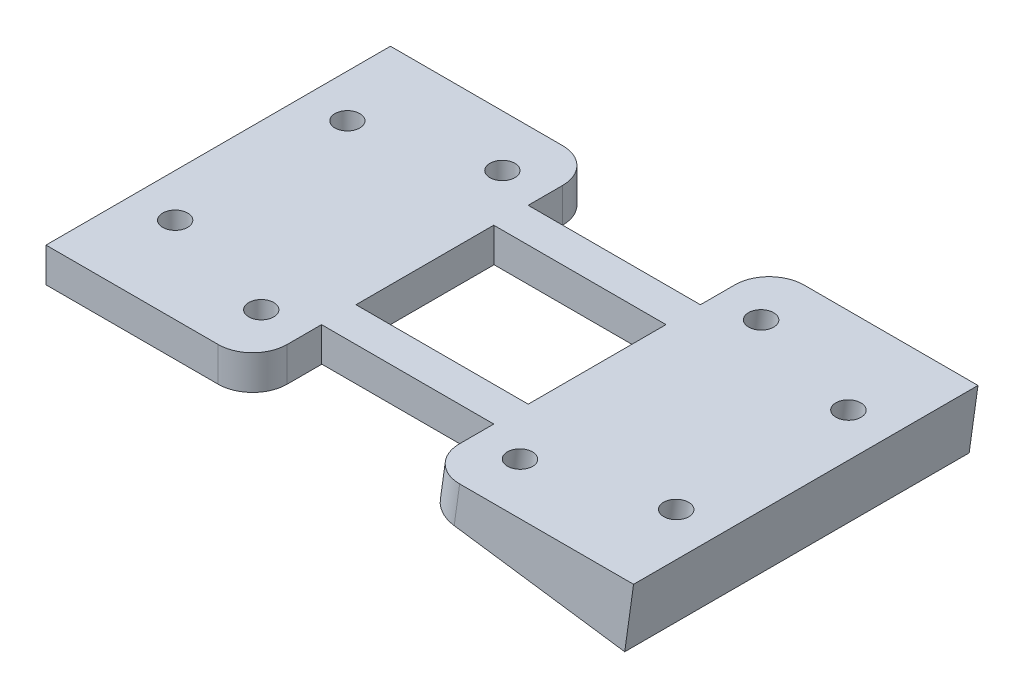
ISO-10303-21;
HEADER;
FILE_DESCRIPTION(('STEP AP214'),'2;1');
FILE_NAME('part.step','',(''),(''),'','','');
FILE_SCHEMA(('AUTOMOTIVE_DESIGN { 1 0 10303 214 1 1 1 1 }'));
ENDSEC;
DATA;
#1=APPLICATION_CONTEXT('core data for automotive mechanical design processes');
#2=APPLICATION_PROTOCOL_DEFINITION('international standard','automotive_design',2000,#1);
#3=PRODUCT_CONTEXT('',#1,'mechanical');
#4=PRODUCT('Part','Part','',(#3));
#5=PRODUCT_RELATED_PRODUCT_CATEGORY('part','',(#4));
#6=PRODUCT_DEFINITION_FORMATION('','',#4);
#7=PRODUCT_DEFINITION_CONTEXT('part definition',#1,'design');
#8=PRODUCT_DEFINITION('design','',#6,#7);
#9=PRODUCT_DEFINITION_SHAPE('','',#8);
#10=(LENGTH_UNIT() NAMED_UNIT(*) SI_UNIT(.MILLI.,.METRE.));
#11=(NAMED_UNIT(*) PLANE_ANGLE_UNIT() SI_UNIT($,.RADIAN.));
#12=(NAMED_UNIT(*) SI_UNIT($,.STERADIAN.) SOLID_ANGLE_UNIT());
#13=UNCERTAINTY_MEASURE_WITH_UNIT(LENGTH_MEASURE(1.E-05),#10,'distance_accuracy_value','');
#14=(GEOMETRIC_REPRESENTATION_CONTEXT(3) GLOBAL_UNCERTAINTY_ASSIGNED_CONTEXT((#13)) GLOBAL_UNIT_ASSIGNED_CONTEXT((#10,
#11,#12)) REPRESENTATION_CONTEXT('',''));
#15=CARTESIAN_POINT('',(0.,0.,0.));
#16=DIRECTION('',(0.,0.,1.));
#17=DIRECTION('',(1.,0.,0.));
#18=AXIS2_PLACEMENT_3D('',#15,#16,#17);
#19=CARTESIAN_POINT('',(16.6048706229787,-3.65061334900384,10.));
#20=DIRECTION('',(0.139173100960058,0.990268068741571,0.));
#21=DIRECTION('',(-0.990268068741571,0.139173100960058,0.));
#22=AXIS2_PLACEMENT_3D('',#19,#20,#21);
#23=PLANE('',#22);
#24=CARTESIAN_POINT('',(14.1292004511248,-3.3026805966037,5.));
#25=DIRECTION('',(0.139173100960059,0.990268068741571,0.));
#26=DIRECTION('',(0.990268068741571,-0.139173100960059,0.));
#27=AXIS2_PLACEMENT_3D('',#24,#25,#26);
#28=CIRCLE('',#27,0.725);
#29=CARTESIAN_POINT('',(14.8471448009625,-3.40358109479974,5.));
#30=VERTEX_POINT('',#29);
#31=EDGE_CURVE('E242',#30,#30,#28,.T.);
#32=ORIENTED_EDGE('',*,*,#31,.T.);
#33=EDGE_LOOP('',(#32));
#34=FACE_BOUND('',#33,.T.);
#35=CARTESIAN_POINT('',(7.19732396993381,-2.32846888988329,-7.));
#36=DIRECTION('',(0.139173100960059,0.990268068741571,0.));
#37=DIRECTION('',(-0.990268068741571,0.139173100960059,0.));
#38=AXIS2_PLACEMENT_3D('',#35,#36,#37);
#39=CIRCLE('',#38,0.725000000000001);
#40=CARTESIAN_POINT('',(6.47937962009617,-2.22756839168725,-7.));
#41=VERTEX_POINT('',#40);
#42=EDGE_CURVE('E234',#41,#41,#39,.T.);
#43=ORIENTED_EDGE('',*,*,#42,.T.);
#44=EDGE_LOOP('',(#43));
#45=FACE_BOUND('',#44,.T.);
#46=DIRECTION('',(0.990268068741571,-0.139173100960058,0.));
#47=VECTOR('',#46,1.);
#48=CARTESIAN_POINT('',(16.6048706229787,-3.65061334900384,10.));
#49=LINE('',#48,#47);
#50=CARTESIAN_POINT('',(6.70218993556303,-2.25888233940326,10.));
#51=VERTEX_POINT('',#50);
#52=CARTESIAN_POINT('',(16.6048706229787,-3.65061334900384,10.));
#53=VERTEX_POINT('',#52);
#54=EDGE_CURVE('E332',#51,#53,#49,.T.);
#55=ORIENTED_EDGE('',*,*,#54,.F.);
#56=CARTESIAN_POINT('',(6.70218993556302,-2.25888233940326,8.));
#57=DIRECTION('',(0.139173100960058,0.990268068741571,0.));
#58=DIRECTION('',(-0.990268068741571,0.139173100960058,0.));
#59=AXIS2_PLACEMENT_3D('',#56,#57,#58);
#60=CIRCLE('',#59,2.);
#61=CARTESIAN_POINT('',(4.72165379807988,-1.98053613748314,8.));
#62=VERTEX_POINT('',#61);
#63=EDGE_CURVE('E251',#51,#62,#60,.F.);
#64=ORIENTED_EDGE('',*,*,#63,.T.);
#65=DIRECTION('',(0.,0.,-1.));
#66=VECTOR('',#65,1.);
#67=CARTESIAN_POINT('',(4.72165379807988,-1.98053613748314,10.));
#68=LINE('',#67,#66);
#69=CARTESIAN_POINT('',(4.72165379807987,-1.98053613748314,6.));
#70=VERTEX_POINT('',#69);
#71=EDGE_CURVE('E218',#62,#70,#68,.T.);
#72=ORIENTED_EDGE('',*,*,#71,.T.);
#73=DIRECTION('',(0.,0.,1.));
#74=VECTOR('',#73,1.);
#75=CARTESIAN_POINT('',(4.72165379807987,-1.98053613748314,10.));
#76=LINE('',#75,#74);
#77=CARTESIAN_POINT('',(4.72165379807988,-1.98053613748314,4.));
#78=VERTEX_POINT('',#77);
#79=EDGE_CURVE('E194',#78,#70,#76,.T.);
#80=ORIENTED_EDGE('',*,*,#79,.F.);
#81=CARTESIAN_POINT('',(4.72165379807987,-1.98053613748314,-4.));
#82=VERTEX_POINT('',#81);
#83=EDGE_CURVE('E192',#78,#82,#68,.T.);
#84=ORIENTED_EDGE('',*,*,#83,.T.);
#85=CARTESIAN_POINT('',(4.72165379807988,-1.98053613748314,-6.));
#86=VERTEX_POINT('',#85);
#87=EDGE_CURVE('E221',#82,#86,#68,.T.);
#88=ORIENTED_EDGE('',*,*,#87,.T.);
#89=CARTESIAN_POINT('',(4.72165379807988,-1.98053613748314,-8.));
#90=VERTEX_POINT('',#89);
#91=EDGE_CURVE('E217',#86,#90,#68,.T.);
#92=ORIENTED_EDGE('',*,*,#91,.T.);
#93=CARTESIAN_POINT('',(6.70218993556303,-2.25888233940326,-8.));
#94=DIRECTION('',(0.139173100960058,0.990268068741571,0.));
#95=DIRECTION('',(-0.990268068741571,0.139173100960058,0.));
#96=AXIS2_PLACEMENT_3D('',#93,#94,#95);
#97=CIRCLE('',#96,2.);
#98=CARTESIAN_POINT('',(6.70218993556303,-2.25888233940326,-10.));
#99=VERTEX_POINT('',#98);
#100=EDGE_CURVE('E249',#90,#99,#97,.F.);
#101=ORIENTED_EDGE('',*,*,#100,.T.);
#102=DIRECTION('',(0.990268068741571,-0.139173100960058,0.));
#103=VECTOR('',#102,1.);
#104=CARTESIAN_POINT('',(16.6048706229787,-3.65061334900384,-10.));
#105=LINE('',#104,#103);
#106=CARTESIAN_POINT('',(16.6048706229787,-3.65061334900384,-10.));
#107=VERTEX_POINT('',#106);
#108=EDGE_CURVE('E331',#99,#107,#105,.T.);
#109=ORIENTED_EDGE('',*,*,#108,.T.);
#110=DIRECTION('',(0.,0.,-1.));
#111=VECTOR('',#110,1.);
#112=CARTESIAN_POINT('',(16.6048706229787,-3.65061334900384,10.));
#113=LINE('',#112,#111);
#114=EDGE_CURVE('E214',#53,#107,#113,.T.);
#115=ORIENTED_EDGE('',*,*,#114,.F.);
#116=EDGE_LOOP('',(#55,#64,#72,#80,#84,#88,#92,#101,#109,#115));
#117=FACE_BOUND('',#116,.T.);
#118=CARTESIAN_POINT('',(14.1292004511248,-3.3026805966037,-5.));
#119=DIRECTION('',(0.139173100960059,0.990268068741571,0.));
#120=DIRECTION('',(-0.990268068741571,0.139173100960059,0.));
#121=AXIS2_PLACEMENT_3D('',#118,#119,#120);
#122=CIRCLE('',#121,0.725);
#123=CARTESIAN_POINT('',(13.4112561012872,-3.20178009840766,-5.));
#124=VERTEX_POINT('',#123);
#125=EDGE_CURVE('E238',#124,#124,#122,.T.);
#126=ORIENTED_EDGE('',*,*,#125,.T.);
#127=EDGE_LOOP('',(#126));
#128=FACE_BOUND('',#127,.T.);
#129=CARTESIAN_POINT('',(7.19732396993381,-2.32846888988329,7.));
#130=DIRECTION('',(0.139173100960059,0.990268068741571,0.));
#131=DIRECTION('',(0.990268068741571,-0.139173100960059,0.));
#132=AXIS2_PLACEMENT_3D('',#129,#130,#131);
#133=CIRCLE('',#132,0.725000000000001);
#134=CARTESIAN_POINT('',(7.91526831977145,-2.42936938807933,7.));
#135=VERTEX_POINT('',#134);
#136=EDGE_CURVE('E246',#135,#135,#133,.T.);
#137=ORIENTED_EDGE('',*,*,#136,.T.);
#138=EDGE_LOOP('',(#137));
#139=FACE_BOUND('',#138,.T.);
#140=ADVANCED_FACE('F33',(#34,#45,#117,#128,#139),#23,.F.);
#141=CARTESIAN_POINT('',(5.,0.,10.));
#142=DIRECTION('',(0.,-1.,0.));
#143=DIRECTION('',(0.,0.,-1.));
#144=AXIS2_PLACEMENT_3D('',#141,#142,#143);
#145=PLANE('',#144);
#146=CARTESIAN_POINT('',(-7.5,1.69569219776733E-13,-7.));
#147=DIRECTION('',(0.,-1.,0.));
#148=DIRECTION('',(-1.,0.,0.));
#149=AXIS2_PLACEMENT_3D('',#146,#147,#148);
#150=CIRCLE('',#149,0.725);
#151=CARTESIAN_POINT('',(-8.225,1.74559672272423E-13,-7.));
#152=VERTEX_POINT('',#151);
#153=EDGE_CURVE('E453',#152,#152,#150,.T.);
#154=ORIENTED_EDGE('',*,*,#153,.T.);
#155=EDGE_LOOP('',(#154));
#156=FACE_BOUND('',#155,.T.);
#157=CARTESIAN_POINT('',(-14.5,2.17707796235089E-13,-5.));
#158=DIRECTION('',(0.,-1.,0.));
#159=DIRECTION('',(-1.,0.,0.));
#160=AXIS2_PLACEMENT_3D('',#157,#158,#159);
#161=CIRCLE('',#160,0.725);
#162=CARTESIAN_POINT('',(-15.225,2.22698248730779E-13,-5.));
#163=VERTEX_POINT('',#162);
#164=EDGE_CURVE('E447',#163,#163,#161,.T.);
#165=ORIENTED_EDGE('',*,*,#164,.T.);
#166=EDGE_LOOP('',(#165));
#167=FACE_BOUND('',#166,.T.);
#168=CARTESIAN_POINT('',(-14.5,2.17707796235089E-13,5.));
#169=DIRECTION('',(0.,-1.,0.));
#170=DIRECTION('',(1.,0.,0.));
#171=AXIS2_PLACEMENT_3D('',#168,#169,#170);
#172=CIRCLE('',#171,0.725);
#173=CARTESIAN_POINT('',(-13.775,2.12717343739399E-13,5.));
#174=VERTEX_POINT('',#173);
#175=EDGE_CURVE('E441',#174,#174,#172,.T.);
#176=ORIENTED_EDGE('',*,*,#175,.T.);
#177=EDGE_LOOP('',(#176));
#178=FACE_BOUND('',#177,.T.);
#179=CARTESIAN_POINT('',(-7.5,1.69569219776733E-13,7.));
#180=DIRECTION('',(0.,-1.,0.));
#181=DIRECTION('',(1.,0.,0.));
#182=AXIS2_PLACEMENT_3D('',#179,#180,#181);
#183=CIRCLE('',#182,0.725);
#184=CARTESIAN_POINT('',(-6.775,1.64578767281043E-13,7.));
#185=VERTEX_POINT('',#184);
#186=EDGE_CURVE('E437',#185,#185,#183,.T.);
#187=ORIENTED_EDGE('',*,*,#186,.T.);
#188=EDGE_LOOP('',(#187));
#189=FACE_BOUND('',#188,.T.);
#190=CARTESIAN_POINT('',(14.5933619389269,0.,5.));
#191=DIRECTION('',(0.,-1.,0.));
#192=DIRECTION('',(-1.,0.,0.));
#193=AXIS2_PLACEMENT_3D('',#190,#191,#192);
#194=ELLIPSE('',#193,0.732124990075997,0.725);
#195=CARTESIAN_POINT('',(13.8612369488509,0.,5.));
#196=VERTEX_POINT('',#195);
#197=EDGE_CURVE('E239',#196,#196,#194,.F.);
#198=ORIENTED_EDGE('',*,*,#197,.F.);
#199=EDGE_LOOP('',(#198));
#200=FACE_BOUND('',#199,.T.);
#201=CARTESIAN_POINT('',(7.52456893129654,0.,-7.));
#202=DIRECTION('',(0.,-1.,0.));
#203=DIRECTION('',(-1.,0.,0.));
#204=AXIS2_PLACEMENT_3D('',#201,#202,#203);
#205=ELLIPSE('',#204,0.732124990075998,0.725000000000001);
#206=CARTESIAN_POINT('',(6.79244394122055,0.,-7.));
#207=VERTEX_POINT('',#206);
#208=EDGE_CURVE('E185',#207,#207,#205,.F.);
#209=ORIENTED_EDGE('',*,*,#208,.F.);
#210=EDGE_LOOP('',(#209));
#211=FACE_BOUND('',#210,.T.);
#212=DIRECTION('',(0.,0.,-1.));
#213=VECTOR('',#212,1.);
#214=CARTESIAN_POINT('',(5.,0.,10.));
#215=LINE('',#214,#213);
#216=CARTESIAN_POINT('',(5.,0.,4.));
#217=VERTEX_POINT('',#216);
#218=CARTESIAN_POINT('',(5.,0.,-4.));
#219=VERTEX_POINT('',#218);
#220=EDGE_CURVE('E190',#217,#219,#215,.T.);
#221=ORIENTED_EDGE('',*,*,#220,.F.);
#222=DIRECTION('',(-1.,0.,0.));
#223=VECTOR('',#222,1.);
#224=CARTESIAN_POINT('',(6.,0.,4.));
#225=LINE('',#224,#223);
#226=CARTESIAN_POINT('',(-5.00000000000001,0.,4.));
#227=VERTEX_POINT('',#226);
#228=EDGE_CURVE('E175',#217,#227,#225,.T.);
#229=ORIENTED_EDGE('',*,*,#228,.T.);
#230=DIRECTION('',(0.,0.,-1.));
#231=VECTOR('',#230,1.);
#232=CARTESIAN_POINT('',(-5.,0.,10.));
#233=LINE('',#232,#231);
#234=CARTESIAN_POINT('',(-5.,0.,-4.));
#235=VERTEX_POINT('',#234);
#236=EDGE_CURVE('E312',#227,#235,#233,.T.);
#237=ORIENTED_EDGE('',*,*,#236,.T.);
#238=DIRECTION('',(-1.,0.,0.));
#239=VECTOR('',#238,1.);
#240=CARTESIAN_POINT('',(6.,0.,-4.));
#241=LINE('',#240,#239);
#242=EDGE_CURVE('E201',#219,#235,#241,.T.);
#243=ORIENTED_EDGE('',*,*,#242,.F.);
#244=EDGE_LOOP('',(#221,#229,#237,#243));
#245=FACE_BOUND('',#244,.T.);
#246=CARTESIAN_POINT('',(-5.,0.,-6.));
#247=VERTEX_POINT('',#246);
#248=CARTESIAN_POINT('',(-5.,0.,-8.));
#249=VERTEX_POINT('',#248);
#250=EDGE_CURVE('E296',#247,#249,#233,.T.);
#251=ORIENTED_EDGE('',*,*,#250,.T.);
#252=CARTESIAN_POINT('',(-7.,0.,-8.));
#253=DIRECTION('',(0.,-1.,0.));
#254=DIRECTION('',(0.,0.,-1.));
#255=AXIS2_PLACEMENT_3D('',#252,#253,#254);
#256=CIRCLE('',#255,2.);
#257=CARTESIAN_POINT('',(-7.,0.,-10.));
#258=VERTEX_POINT('',#257);
#259=EDGE_CURVE('E271',#249,#258,#256,.F.);
#260=ORIENTED_EDGE('',*,*,#259,.T.);
#261=DIRECTION('',(-1.,0.,0.));
#262=VECTOR('',#261,1.);
#263=CARTESIAN_POINT('',(-5.,0.,-10.));
#264=LINE('',#263,#262);
#265=CARTESIAN_POINT('',(-17.,0.,-10.));
#266=VERTEX_POINT('',#265);
#267=EDGE_CURVE('E293',#258,#266,#264,.T.);
#268=ORIENTED_EDGE('',*,*,#267,.T.);
#269=DIRECTION('',(0.,0.,-1.));
#270=VECTOR('',#269,1.);
#271=CARTESIAN_POINT('',(-17.,0.,10.));
#272=LINE('',#271,#270);
#273=CARTESIAN_POINT('',(-17.,0.,10.));
#274=VERTEX_POINT('',#273);
#275=EDGE_CURVE('E309',#274,#266,#272,.T.);
#276=ORIENTED_EDGE('',*,*,#275,.F.);
#277=DIRECTION('',(-1.,0.,0.));
#278=VECTOR('',#277,1.);
#279=CARTESIAN_POINT('',(-5.,0.,10.));
#280=LINE('',#279,#278);
#281=CARTESIAN_POINT('',(-7.,0.,10.));
#282=VERTEX_POINT('',#281);
#283=EDGE_CURVE('E416',#282,#274,#280,.T.);
#284=ORIENTED_EDGE('',*,*,#283,.F.);
#285=CARTESIAN_POINT('',(-7.,0.,8.));
#286=DIRECTION('',(0.,-1.,0.));
#287=DIRECTION('',(0.,0.,-1.));
#288=AXIS2_PLACEMENT_3D('',#285,#286,#287);
#289=CIRCLE('',#288,2.);
#290=CARTESIAN_POINT('',(-5.,0.,8.));
#291=VERTEX_POINT('',#290);
#292=EDGE_CURVE('E269',#282,#291,#289,.F.);
#293=ORIENTED_EDGE('',*,*,#292,.T.);
#294=CARTESIAN_POINT('',(-5.,0.,6.));
#295=VERTEX_POINT('',#294);
#296=EDGE_CURVE('E288',#291,#295,#233,.T.);
#297=ORIENTED_EDGE('',*,*,#296,.T.);
#298=DIRECTION('',(-1.,0.,0.));
#299=VECTOR('',#298,1.);
#300=CARTESIAN_POINT('',(6.,0.,6.));
#301=LINE('',#300,#299);
#302=CARTESIAN_POINT('',(5.,0.,6.));
#303=VERTEX_POINT('',#302);
#304=EDGE_CURVE('E195',#303,#295,#301,.T.);
#305=ORIENTED_EDGE('',*,*,#304,.F.);
#306=CARTESIAN_POINT('',(5.,0.,8.));
#307=VERTEX_POINT('',#306);
#308=EDGE_CURVE('E202',#307,#303,#215,.T.);
#309=ORIENTED_EDGE('',*,*,#308,.F.);
#310=CARTESIAN_POINT('',(7.01965514503723,0.,8.));
#311=DIRECTION('',(0.,-1.,0.));
#312=DIRECTION('',(-1.,0.,0.));
#313=AXIS2_PLACEMENT_3D('',#310,#311,#312);
#314=ELLIPSE('',#313,2.01965514503723,2.);
#315=CARTESIAN_POINT('',(7.01965514503723,0.,10.));
#316=VERTEX_POINT('',#315);
#317=EDGE_CURVE('E257',#307,#316,#314,.F.);
#318=ORIENTED_EDGE('',*,*,#317,.T.);
#319=DIRECTION('',(-1.,0.,0.));
#320=VECTOR('',#319,1.);
#321=CARTESIAN_POINT('',(5.,0.,10.));
#322=LINE('',#321,#320);
#323=CARTESIAN_POINT('',(17.1179308702234,0.,10.));
#324=VERTEX_POINT('',#323);
#325=EDGE_CURVE('E207',#324,#316,#322,.T.);
#326=ORIENTED_EDGE('',*,*,#325,.F.);
#327=DIRECTION('',(0.,0.,-1.));
#328=VECTOR('',#327,1.);
#329=CARTESIAN_POINT('',(17.1179308702234,0.,10.));
#330=LINE('',#329,#328);
#331=CARTESIAN_POINT('',(17.1179308702234,0.,-10.));
#332=VERTEX_POINT('',#331);
#333=EDGE_CURVE('E205',#324,#332,#330,.T.);
#334=ORIENTED_EDGE('',*,*,#333,.T.);
#335=DIRECTION('',(-1.,0.,0.));
#336=VECTOR('',#335,1.);
#337=CARTESIAN_POINT('',(5.,0.,-10.));
#338=LINE('',#337,#336);
#339=CARTESIAN_POINT('',(7.01965514503723,0.,-10.));
#340=VERTEX_POINT('',#339);
#341=EDGE_CURVE('E210',#332,#340,#338,.T.);
#342=ORIENTED_EDGE('',*,*,#341,.T.);
#343=CARTESIAN_POINT('',(7.01965514503723,0.,-8.));
#344=DIRECTION('',(0.,-1.,0.));
#345=DIRECTION('',(1.,0.,0.));
#346=AXIS2_PLACEMENT_3D('',#343,#344,#345);
#347=ELLIPSE('',#346,2.01965514503723,2.);
#348=CARTESIAN_POINT('',(5.,0.,-8.));
#349=VERTEX_POINT('',#348);
#350=EDGE_CURVE('E255',#340,#349,#347,.F.);
#351=ORIENTED_EDGE('',*,*,#350,.T.);
#352=CARTESIAN_POINT('',(5.,0.,-6.));
#353=VERTEX_POINT('',#352);
#354=EDGE_CURVE('E203',#353,#349,#215,.T.);
#355=ORIENTED_EDGE('',*,*,#354,.F.);
#356=DIRECTION('',(-1.,0.,0.));
#357=VECTOR('',#356,1.);
#358=CARTESIAN_POINT('',(6.,0.,-6.));
#359=LINE('',#358,#357);
#360=EDGE_CURVE('E324',#353,#247,#359,.T.);
#361=ORIENTED_EDGE('',*,*,#360,.T.);
#362=EDGE_LOOP('',(#251,#260,#268,#276,#284,#293,#297,#305,#309,#318,#326,#334,#342,#351,#355,#361));
#363=FACE_BOUND('',#362,.T.);
#364=CARTESIAN_POINT('',(14.5933619389269,0.,-5.));
#365=DIRECTION('',(0.,-1.,0.));
#366=DIRECTION('',(-1.,0.,0.));
#367=AXIS2_PLACEMENT_3D('',#364,#365,#366);
#368=ELLIPSE('',#367,0.732124990075997,0.725);
#369=CARTESIAN_POINT('',(13.8612369488509,0.,-5.));
#370=VERTEX_POINT('',#369);
#371=EDGE_CURVE('E235',#370,#370,#368,.F.);
#372=ORIENTED_EDGE('',*,*,#371,.F.);
#373=EDGE_LOOP('',(#372));
#374=FACE_BOUND('',#373,.T.);
#375=CARTESIAN_POINT('',(7.52456893129654,0.,7.));
#376=DIRECTION('',(0.,-1.,0.));
#377=DIRECTION('',(-1.,0.,0.));
#378=AXIS2_PLACEMENT_3D('',#375,#376,#377);
#379=ELLIPSE('',#378,0.732124990075998,0.725000000000001);
#380=CARTESIAN_POINT('',(6.79244394122055,0.,7.));
#381=VERTEX_POINT('',#380);
#382=EDGE_CURVE('E243',#381,#381,#379,.F.);
#383=ORIENTED_EDGE('',*,*,#382,.F.);
#384=EDGE_LOOP('',(#383));
#385=FACE_BOUND('',#384,.T.);
#386=ADVANCED_FACE('F198',(#156,#167,#178,#189,#200,#211,#245,#363,#374,#385),#145,.F.);
#387=CARTESIAN_POINT('',(5.,0.,10.));
#388=DIRECTION('',(0.990268068741571,-0.139173100960058,0.));
#389=DIRECTION('',(0.139173100960058,0.990268068741571,0.));
#390=AXIS2_PLACEMENT_3D('',#387,#388,#389);
#391=PLANE('',#390);
#392=ORIENTED_EDGE('',*,*,#71,.F.);
#393=DIRECTION('',(-0.139173100960058,-0.990268068741571,0.));
#394=VECTOR('',#393,1.);
#395=CARTESIAN_POINT('',(5.,0.,8.));
#396=LINE('',#395,#394);
#397=EDGE_CURVE('E253',#62,#307,#396,.F.);
#398=ORIENTED_EDGE('',*,*,#397,.T.);
#399=ORIENTED_EDGE('',*,*,#308,.T.);
#400=DIRECTION('',(0.139173100960058,0.990268068741571,0.));
#401=VECTOR('',#400,1.);
#402=CARTESIAN_POINT('',(5.,0.,6.));
#403=LINE('',#402,#401);
#404=EDGE_CURVE('E303',#70,#303,#403,.T.);
#405=ORIENTED_EDGE('',*,*,#404,.F.);
#406=EDGE_LOOP('',(#392,#398,#399,#405));
#407=FACE_BOUND('',#406,.T.);
#408=ADVANCED_FACE('F389',(#407),#391,.F.);
#409=DIRECTION('',(-0.139173100960058,-0.990268068741571,0.));
#410=VECTOR('',#409,1.);
#411=CARTESIAN_POINT('',(5.,0.,4.));
#412=LINE('',#411,#410);
#413=EDGE_CURVE('E179',#217,#78,#412,.T.);
#414=ORIENTED_EDGE('',*,*,#413,.F.);
#415=ORIENTED_EDGE('',*,*,#220,.T.);
#416=DIRECTION('',(0.139173100960058,0.990268068741571,0.));
#417=VECTOR('',#416,1.);
#418=CARTESIAN_POINT('',(5.,0.,-4.));
#419=LINE('',#418,#417);
#420=EDGE_CURVE('E326',#82,#219,#419,.T.);
#421=ORIENTED_EDGE('',*,*,#420,.F.);
#422=ORIENTED_EDGE('',*,*,#83,.F.);
#423=EDGE_LOOP('',(#414,#415,#421,#422));
#424=FACE_BOUND('',#423,.T.);
#425=ADVANCED_FACE('F188',(#424),#391,.F.);
#426=CARTESIAN_POINT('',(-5.00000000000001,-2.,10.));
#427=DIRECTION('',(-1.,0.,0.));
#428=DIRECTION('',(0.,-1.,0.));
#429=AXIS2_PLACEMENT_3D('',#426,#427,#428);
#430=PLANE('',#429);
#431=DIRECTION('',(0.,0.,-1.));
#432=VECTOR('',#431,1.);
#433=CARTESIAN_POINT('',(-5.00000000000001,-2.,10.));
#434=LINE('',#433,#432);
#435=CARTESIAN_POINT('',(-5.00000000000001,-2.,8.));
#436=VERTEX_POINT('',#435);
#437=CARTESIAN_POINT('',(-5.00000000000001,-2.,-8.));
#438=VERTEX_POINT('',#437);
#439=EDGE_CURVE('E277',#436,#438,#434,.T.);
#440=ORIENTED_EDGE('',*,*,#439,.T.);
#441=DIRECTION('',(0.,1.,0.));
#442=VECTOR('',#441,1.);
#443=CARTESIAN_POINT('',(-5.00000000000001,-2.,-8.));
#444=LINE('',#443,#442);
#445=EDGE_CURVE('E266',#438,#249,#444,.T.);
#446=ORIENTED_EDGE('',*,*,#445,.T.);
#447=ORIENTED_EDGE('',*,*,#250,.F.);
#448=DIRECTION('',(0.,-1.,0.));
#449=VECTOR('',#448,1.);
#450=CARTESIAN_POINT('',(-5.,0.,-6.));
#451=LINE('',#450,#449);
#452=CARTESIAN_POINT('',(-5.00000000000001,-1.98053613748314,-6.));
#453=VERTEX_POINT('',#452);
#454=EDGE_CURVE('E315',#247,#453,#451,.T.);
#455=ORIENTED_EDGE('',*,*,#454,.T.);
#456=DIRECTION('',(0.,0.,1.));
#457=VECTOR('',#456,1.);
#458=CARTESIAN_POINT('',(-5.00000000000001,-1.98053613748314,-6.));
#459=LINE('',#458,#457);
#460=CARTESIAN_POINT('',(-5.00000000000001,-1.98053613748314,-4.));
#461=VERTEX_POINT('',#460);
#462=EDGE_CURVE('E287',#453,#461,#459,.T.);
#463=ORIENTED_EDGE('',*,*,#462,.T.);
#464=DIRECTION('',(0.,1.,0.));
#465=VECTOR('',#464,1.);
#466=CARTESIAN_POINT('',(-5.,0.,-4.));
#467=LINE('',#466,#465);
#468=EDGE_CURVE('E220',#461,#235,#467,.T.);
#469=ORIENTED_EDGE('',*,*,#468,.T.);
#470=ORIENTED_EDGE('',*,*,#236,.F.);
#471=DIRECTION('',(0.,1.,0.));
#472=VECTOR('',#471,1.);
#473=CARTESIAN_POINT('',(-5.00000000000001,-2.,4.));
#474=LINE('',#473,#472);
#475=CARTESIAN_POINT('',(-5.00000000000001,-1.98053613748314,4.));
#476=VERTEX_POINT('',#475);
#477=EDGE_CURVE('E181',#476,#227,#474,.T.);
#478=ORIENTED_EDGE('',*,*,#477,.F.);
#479=DIRECTION('',(0.,0.,-1.));
#480=VECTOR('',#479,1.);
#481=CARTESIAN_POINT('',(-5.00000000000001,-1.98053613748314,10.));
#482=LINE('',#481,#480);
#483=CARTESIAN_POINT('',(-5.00000000000001,-1.98053613748314,6.));
#484=VERTEX_POINT('',#483);
#485=EDGE_CURVE('E225',#484,#476,#482,.T.);
#486=ORIENTED_EDGE('',*,*,#485,.F.);
#487=DIRECTION('',(0.,-1.,0.));
#488=VECTOR('',#487,1.);
#489=CARTESIAN_POINT('',(-5.00000000000001,-2.,6.));
#490=LINE('',#489,#488);
#491=EDGE_CURVE('E228',#295,#484,#490,.T.);
#492=ORIENTED_EDGE('',*,*,#491,.F.);
#493=ORIENTED_EDGE('',*,*,#296,.F.);
#494=DIRECTION('',(0.,1.,0.));
#495=VECTOR('',#494,1.);
#496=CARTESIAN_POINT('',(-5.00000000000001,-2.,8.));
#497=LINE('',#496,#495);
#498=EDGE_CURVE('E264',#291,#436,#497,.F.);
#499=ORIENTED_EDGE('',*,*,#498,.T.);
#500=EDGE_LOOP('',(#440,#446,#447,#455,#463,#469,#470,#478,#486,#492,#493,#499));
#501=FACE_BOUND('',#500,.T.);
#502=ADVANCED_FACE('F283',(#501),#430,.F.);
#503=CARTESIAN_POINT('',(6.,-1.98053613748314,-6.));
#504=DIRECTION('',(0.,1.,0.));
#505=DIRECTION('',(0.,0.,1.));
#506=AXIS2_PLACEMENT_3D('',#503,#504,#505);
#507=PLANE('',#506);
#508=ORIENTED_EDGE('',*,*,#462,.F.);
#509=DIRECTION('',(-1.,0.,0.));
#510=VECTOR('',#509,1.);
#511=CARTESIAN_POINT('',(6.,-1.98053613748314,-6.));
#512=LINE('',#511,#510);
#513=EDGE_CURVE('E317',#86,#453,#512,.T.);
#514=ORIENTED_EDGE('',*,*,#513,.F.);
#515=ORIENTED_EDGE('',*,*,#87,.F.);
#516=DIRECTION('',(-1.,0.,0.));
#517=VECTOR('',#516,1.);
#518=CARTESIAN_POINT('',(6.,-1.98053613748314,-4.));
#519=LINE('',#518,#517);
#520=EDGE_CURVE('E320',#82,#461,#519,.T.);
#521=ORIENTED_EDGE('',*,*,#520,.T.);
#522=EDGE_LOOP('',(#508,#514,#515,#521));
#523=FACE_BOUND('',#522,.T.);
#524=ADVANCED_FACE('F367',(#523),#507,.F.);
#525=CARTESIAN_POINT('',(6.,0.,-6.));
#526=DIRECTION('',(0.,0.,1.));
#527=DIRECTION('',(1.,0.,0.));
#528=AXIS2_PLACEMENT_3D('',#525,#526,#527);
#529=PLANE('',#528);
#530=ORIENTED_EDGE('',*,*,#454,.F.);
#531=ORIENTED_EDGE('',*,*,#360,.F.);
#532=DIRECTION('',(-0.139173100960058,-0.990268068741571,0.));
#533=VECTOR('',#532,1.);
#534=CARTESIAN_POINT('',(5.,0.,-6.));
#535=LINE('',#534,#533);
#536=EDGE_CURVE('E328',#353,#86,#535,.T.);
#537=ORIENTED_EDGE('',*,*,#536,.T.);
#538=ORIENTED_EDGE('',*,*,#513,.T.);
#539=EDGE_LOOP('',(#530,#531,#537,#538));
#540=FACE_BOUND('',#539,.T.);
#541=ADVANCED_FACE('F373',(#540),#529,.F.);
#542=CARTESIAN_POINT('',(6.,0.,-4.));
#543=DIRECTION('',(0.,0.,-1.));
#544=DIRECTION('',(-1.,0.,0.));
#545=AXIS2_PLACEMENT_3D('',#542,#543,#544);
#546=PLANE('',#545);
#547=ORIENTED_EDGE('',*,*,#468,.F.);
#548=ORIENTED_EDGE('',*,*,#520,.F.);
#549=ORIENTED_EDGE('',*,*,#420,.T.);
#550=ORIENTED_EDGE('',*,*,#242,.T.);
#551=EDGE_LOOP('',(#547,#548,#549,#550));
#552=FACE_BOUND('',#551,.T.);
#553=ADVANCED_FACE('F370',(#552),#546,.F.);
#554=ORIENTED_EDGE('',*,*,#354,.T.);
#555=DIRECTION('',(-0.139173100960058,-0.990268068741571,0.));
#556=VECTOR('',#555,1.);
#557=CARTESIAN_POINT('',(4.72165379807988,-1.98053613748314,-8.));
#558=LINE('',#557,#556);
#559=EDGE_CURVE('E259',#349,#90,#558,.T.);
#560=ORIENTED_EDGE('',*,*,#559,.T.);
#561=ORIENTED_EDGE('',*,*,#91,.F.);
#562=ORIENTED_EDGE('',*,*,#536,.F.);
#563=EDGE_LOOP('',(#554,#560,#561,#562));
#564=FACE_BOUND('',#563,.T.);
#565=ADVANCED_FACE('F355',(#564),#391,.F.);
#566=CARTESIAN_POINT('',(17.1179308702234,0.,10.));
#567=DIRECTION('',(-0.990268068741571,0.139173100960058,0.));
#568=DIRECTION('',(-0.139173100960058,-0.990268068741571,0.));
#569=AXIS2_PLACEMENT_3D('',#566,#567,#568);
#570=PLANE('',#569);
#571=DIRECTION('',(0.139173100960058,0.990268068741571,0.));
#572=VECTOR('',#571,1.);
#573=CARTESIAN_POINT('',(17.1179308702234,0.,-10.));
#574=LINE('',#573,#572);
#575=EDGE_CURVE('E338',#107,#332,#574,.T.);
#576=ORIENTED_EDGE('',*,*,#575,.T.);
#577=ORIENTED_EDGE('',*,*,#333,.F.);
#578=DIRECTION('',(0.139173100960058,0.990268068741571,0.));
#579=VECTOR('',#578,1.);
#580=CARTESIAN_POINT('',(17.1179308702234,0.,10.));
#581=LINE('',#580,#579);
#582=EDGE_CURVE('E334',#53,#324,#581,.T.);
#583=ORIENTED_EDGE('',*,*,#582,.F.);
#584=ORIENTED_EDGE('',*,*,#114,.T.);
#585=EDGE_LOOP('',(#576,#577,#583,#584));
#586=FACE_BOUND('',#585,.T.);
#587=ADVANCED_FACE('F396',(#586),#570,.F.);
#588=CARTESIAN_POINT('',(0.,0.,10.));
#589=DIRECTION('',(0.,0.,-1.));
#590=DIRECTION('',(-1.,0.,0.));
#591=AXIS2_PLACEMENT_3D('',#588,#589,#590);
#592=PLANE('',#591);
#593=ORIENTED_EDGE('',*,*,#325,.T.);
#594=DIRECTION('',(-0.139173100960058,-0.990268068741571,0.));
#595=VECTOR('',#594,1.);
#596=CARTESIAN_POINT('',(6.88369037732895,-0.967439591462579,10.));
#597=LINE('',#596,#595);
#598=EDGE_CURVE('E231',#316,#51,#597,.T.);
#599=ORIENTED_EDGE('',*,*,#598,.T.);
#600=ORIENTED_EDGE('',*,*,#54,.T.);
#601=ORIENTED_EDGE('',*,*,#582,.T.);
#602=EDGE_LOOP('',(#593,#599,#600,#601));
#603=FACE_BOUND('',#602,.T.);
#604=ADVANCED_FACE('F544',(#603),#592,.F.);
#605=CARTESIAN_POINT('',(0.,0.,-10.));
#606=DIRECTION('',(0.,0.,-1.));
#607=DIRECTION('',(-1.,0.,0.));
#608=AXIS2_PLACEMENT_3D('',#605,#606,#607);
#609=PLANE('',#608);
#610=ORIENTED_EDGE('',*,*,#108,.F.);
#611=DIRECTION('',(-0.139173100960058,-0.990268068741571,0.));
#612=VECTOR('',#611,1.);
#613=CARTESIAN_POINT('',(6.98053613748314,-0.278346201920117,-10.));
#614=LINE('',#613,#612);
#615=EDGE_CURVE('E262',#99,#340,#614,.F.);
#616=ORIENTED_EDGE('',*,*,#615,.T.);
#617=ORIENTED_EDGE('',*,*,#341,.F.);
#618=ORIENTED_EDGE('',*,*,#575,.F.);
#619=EDGE_LOOP('',(#610,#616,#617,#618));
#620=FACE_BOUND('',#619,.T.);
#621=ADVANCED_FACE('F472',(#620),#609,.T.);
#622=CARTESIAN_POINT('',(-17.,-1.99999999999992,10.));
#623=DIRECTION('',(0.,1.,0.));
#624=DIRECTION('',(-1.,0.,0.));
#625=AXIS2_PLACEMENT_3D('',#622,#623,#624);
#626=PLANE('',#625);
#627=CARTESIAN_POINT('',(-7.50000000000001,-1.99999999999998,-7.));
#628=DIRECTION('',(0.,-1.,0.));
#629=DIRECTION('',(-1.,0.,0.));
#630=AXIS2_PLACEMENT_3D('',#627,#628,#629);
#631=CIRCLE('',#630,0.725);
#632=CARTESIAN_POINT('',(-8.22500000000001,-1.99999999999998,-7.));
#633=VERTEX_POINT('',#632);
#634=EDGE_CURVE('E456',#633,#633,#631,.T.);
#635=ORIENTED_EDGE('',*,*,#634,.F.);
#636=EDGE_LOOP('',(#635));
#637=FACE_BOUND('',#636,.T.);
#638=CARTESIAN_POINT('',(-14.5,-1.99999999999993,-5.));
#639=DIRECTION('',(0.,-1.,0.));
#640=DIRECTION('',(-1.,0.,0.));
#641=AXIS2_PLACEMENT_3D('',#638,#639,#640);
#642=CIRCLE('',#641,0.725);
#643=CARTESIAN_POINT('',(-15.225,-1.99999999999993,-5.));
#644=VERTEX_POINT('',#643);
#645=EDGE_CURVE('E450',#644,#644,#642,.T.);
#646=ORIENTED_EDGE('',*,*,#645,.F.);
#647=EDGE_LOOP('',(#646));
#648=FACE_BOUND('',#647,.T.);
#649=CARTESIAN_POINT('',(-14.5,-1.99999999999993,5.));
#650=DIRECTION('',(0.,-1.,0.));
#651=DIRECTION('',(1.,0.,0.));
#652=AXIS2_PLACEMENT_3D('',#649,#650,#651);
#653=CIRCLE('',#652,0.725);
#654=CARTESIAN_POINT('',(-13.775,-1.99999999999994,5.));
#655=VERTEX_POINT('',#654);
#656=EDGE_CURVE('E444',#655,#655,#653,.T.);
#657=ORIENTED_EDGE('',*,*,#656,.F.);
#658=EDGE_LOOP('',(#657));
#659=FACE_BOUND('',#658,.T.);
#660=CARTESIAN_POINT('',(-7.50000000000001,-1.99999999999998,7.));
#661=DIRECTION('',(0.,-1.,0.));
#662=DIRECTION('',(1.,0.,0.));
#663=AXIS2_PLACEMENT_3D('',#660,#661,#662);
#664=CIRCLE('',#663,0.725);
#665=CARTESIAN_POINT('',(-6.77500000000001,-1.99999999999999,7.));
#666=VERTEX_POINT('',#665);
#667=EDGE_CURVE('E438',#666,#666,#664,.T.);
#668=ORIENTED_EDGE('',*,*,#667,.F.);
#669=EDGE_LOOP('',(#668));
#670=FACE_BOUND('',#669,.T.);
#671=DIRECTION('',(1.,0.,0.));
#672=VECTOR('',#671,1.);
#673=CARTESIAN_POINT('',(-17.,-1.99999999999992,-10.));
#674=LINE('',#673,#672);
#675=CARTESIAN_POINT('',(-17.,-1.99999999999992,-10.));
#676=VERTEX_POINT('',#675);
#677=CARTESIAN_POINT('',(-7.00000000000002,-1.99999999999999,-10.));
#678=VERTEX_POINT('',#677);
#679=EDGE_CURVE('E279',#676,#678,#674,.T.);
#680=ORIENTED_EDGE('',*,*,#679,.T.);
#681=CARTESIAN_POINT('',(-7.00000000000001,-1.99999999999999,-8.));
#682=DIRECTION('',(0.,1.,0.));
#683=DIRECTION('',(-1.,0.,0.));
#684=AXIS2_PLACEMENT_3D('',#681,#682,#683);
#685=CIRCLE('',#684,2.);
#686=EDGE_CURVE('E41',#678,#438,#685,.F.);
#687=ORIENTED_EDGE('',*,*,#686,.T.);
#688=ORIENTED_EDGE('',*,*,#439,.F.);
#689=CARTESIAN_POINT('',(-7.00000000000001,-1.99999999999999,8.));
#690=DIRECTION('',(0.,1.,0.));
#691=DIRECTION('',(-1.,0.,0.));
#692=AXIS2_PLACEMENT_3D('',#689,#690,#691);
#693=CIRCLE('',#692,2.);
#694=CARTESIAN_POINT('',(-7.00000000000002,-1.99999999999999,10.));
#695=VERTEX_POINT('',#694);
#696=EDGE_CURVE('E48',#436,#695,#693,.F.);
#697=ORIENTED_EDGE('',*,*,#696,.T.);
#698=DIRECTION('',(1.,0.,0.));
#699=VECTOR('',#698,1.);
#700=CARTESIAN_POINT('',(-17.,-1.99999999999992,10.));
#701=LINE('',#700,#699);
#702=CARTESIAN_POINT('',(-17.,-1.99999999999992,10.));
#703=VERTEX_POINT('',#702);
#704=EDGE_CURVE('E301',#703,#695,#701,.T.);
#705=ORIENTED_EDGE('',*,*,#704,.F.);
#706=DIRECTION('',(0.,0.,-1.));
#707=VECTOR('',#706,1.);
#708=CARTESIAN_POINT('',(-17.,-1.99999999999992,10.));
#709=LINE('',#708,#707);
#710=EDGE_CURVE('E307',#703,#676,#709,.T.);
#711=ORIENTED_EDGE('',*,*,#710,.T.);
#712=EDGE_LOOP('',(#680,#687,#688,#697,#705,#711));
#713=FACE_BOUND('',#712,.T.);
#714=ADVANCED_FACE('F276',(#637,#648,#659,#670,#713),#626,.F.);
#715=CARTESIAN_POINT('',(-17.,0.,10.));
#716=DIRECTION('',(1.,0.,0.));
#717=DIRECTION('',(0.,0.,-1.));
#718=AXIS2_PLACEMENT_3D('',#715,#716,#717);
#719=PLANE('',#718);
#720=DIRECTION('',(0.,-1.,0.));
#721=VECTOR('',#720,1.);
#722=CARTESIAN_POINT('',(-17.,0.,-10.));
#723=LINE('',#722,#721);
#724=EDGE_CURVE('E299',#266,#676,#723,.T.);
#725=ORIENTED_EDGE('',*,*,#724,.T.);
#726=ORIENTED_EDGE('',*,*,#710,.F.);
#727=DIRECTION('',(0.,-1.,0.));
#728=VECTOR('',#727,1.);
#729=CARTESIAN_POINT('',(-17.,0.,10.));
#730=LINE('',#729,#728);
#731=EDGE_CURVE('E310',#274,#703,#730,.T.);
#732=ORIENTED_EDGE('',*,*,#731,.F.);
#733=ORIENTED_EDGE('',*,*,#275,.T.);
#734=EDGE_LOOP('',(#725,#726,#732,#733));
#735=FACE_BOUND('',#734,.T.);
#736=ADVANCED_FACE('F471',(#735),#719,.F.);
#737=CARTESIAN_POINT('',(0.,0.,10.));
#738=DIRECTION('',(0.,0.,1.));
#739=DIRECTION('',(1.,0.,0.));
#740=AXIS2_PLACEMENT_3D('',#737,#738,#739);
#741=PLANE('',#740);
#742=ORIENTED_EDGE('',*,*,#704,.T.);
#743=DIRECTION('',(0.,1.,0.));
#744=VECTOR('',#743,1.);
#745=CARTESIAN_POINT('',(-7.,0.,10.));
#746=LINE('',#745,#744);
#747=EDGE_CURVE('E11',#695,#282,#746,.T.);
#748=ORIENTED_EDGE('',*,*,#747,.T.);
#749=ORIENTED_EDGE('',*,*,#283,.T.);
#750=ORIENTED_EDGE('',*,*,#731,.T.);
#751=EDGE_LOOP('',(#742,#748,#749,#750));
#752=FACE_BOUND('',#751,.T.);
#753=ADVANCED_FACE('F415',(#752),#741,.T.);
#754=CARTESIAN_POINT('',(0.,0.,-10.));
#755=DIRECTION('',(0.,0.,1.));
#756=DIRECTION('',(1.,0.,0.));
#757=AXIS2_PLACEMENT_3D('',#754,#755,#756);
#758=PLANE('',#757);
#759=ORIENTED_EDGE('',*,*,#267,.F.);
#760=DIRECTION('',(0.,1.,0.));
#761=VECTOR('',#760,1.);
#762=CARTESIAN_POINT('',(-7.,0.,-10.));
#763=LINE('',#762,#761);
#764=EDGE_CURVE('E56',#258,#678,#763,.F.);
#765=ORIENTED_EDGE('',*,*,#764,.T.);
#766=ORIENTED_EDGE('',*,*,#679,.F.);
#767=ORIENTED_EDGE('',*,*,#724,.F.);
#768=EDGE_LOOP('',(#759,#765,#766,#767));
#769=FACE_BOUND('',#768,.T.);
#770=ADVANCED_FACE('F298',(#769),#758,.F.);
#771=CARTESIAN_POINT('',(6.,0.,6.));
#772=DIRECTION('',(0.,0.,-1.));
#773=DIRECTION('',(-1.,0.,0.));
#774=AXIS2_PLACEMENT_3D('',#771,#772,#773);
#775=PLANE('',#774);
#776=DIRECTION('',(-1.,0.,0.));
#777=VECTOR('',#776,1.);
#778=CARTESIAN_POINT('',(6.,-1.98053613748314,6.));
#779=LINE('',#778,#777);
#780=EDGE_CURVE('E426',#70,#484,#779,.T.);
#781=ORIENTED_EDGE('',*,*,#780,.F.);
#782=ORIENTED_EDGE('',*,*,#404,.T.);
#783=ORIENTED_EDGE('',*,*,#304,.T.);
#784=ORIENTED_EDGE('',*,*,#491,.T.);
#785=EDGE_LOOP('',(#781,#782,#783,#784));
#786=FACE_BOUND('',#785,.T.);
#787=ADVANCED_FACE('F514',(#786),#775,.F.);
#788=CARTESIAN_POINT('',(6.,-1.98053613748314,6.));
#789=DIRECTION('',(0.,1.,0.));
#790=DIRECTION('',(0.,0.,1.));
#791=AXIS2_PLACEMENT_3D('',#788,#789,#790);
#792=PLANE('',#791);
#793=DIRECTION('',(-1.,0.,0.));
#794=VECTOR('',#793,1.);
#795=CARTESIAN_POINT('',(6.,-1.98053613748314,4.));
#796=LINE('',#795,#794);
#797=EDGE_CURVE('E184',#78,#476,#796,.T.);
#798=ORIENTED_EDGE('',*,*,#797,.F.);
#799=ORIENTED_EDGE('',*,*,#79,.T.);
#800=ORIENTED_EDGE('',*,*,#780,.T.);
#801=ORIENTED_EDGE('',*,*,#485,.T.);
#802=EDGE_LOOP('',(#798,#799,#800,#801));
#803=FACE_BOUND('',#802,.T.);
#804=ADVANCED_FACE('F511',(#803),#792,.F.);
#805=CARTESIAN_POINT('',(6.,0.,4.));
#806=DIRECTION('',(0.,0.,1.));
#807=DIRECTION('',(1.,0.,0.));
#808=AXIS2_PLACEMENT_3D('',#805,#806,#807);
#809=PLANE('',#808);
#810=ORIENTED_EDGE('',*,*,#228,.F.);
#811=ORIENTED_EDGE('',*,*,#413,.T.);
#812=ORIENTED_EDGE('',*,*,#797,.T.);
#813=ORIENTED_EDGE('',*,*,#477,.T.);
#814=EDGE_LOOP('',(#810,#811,#812,#813));
#815=FACE_BOUND('',#814,.T.);
#816=ADVANCED_FACE('F177',(#815),#809,.F.);
#817=CARTESIAN_POINT('',(7.71038421717848,1.32214445912056,-7.));
#818=DIRECTION('',(-0.139173100960059,-0.990268068741571,0.));
#819=DIRECTION('',(0.990268068741571,-0.139173100960059,0.));
#820=AXIS2_PLACEMENT_3D('',#817,#818,#819);
#821=CYLINDRICAL_SURFACE('',#820,0.725000000000001);
#822=ORIENTED_EDGE('',*,*,#42,.F.);
#823=EDGE_LOOP('',(#822));
#824=FACE_BOUND('',#823,.T.);
#825=ORIENTED_EDGE('',*,*,#208,.T.);
#826=EDGE_LOOP('',(#825));
#827=FACE_BOUND('',#826,.T.);
#828=ADVANCED_FACE('F504',(#824,#827),#821,.F.);
#829=CARTESIAN_POINT('',(14.6422606983695,0.347932752400147,-5.));
#830=DIRECTION('',(-0.139173100960059,-0.990268068741571,0.));
#831=DIRECTION('',(0.990268068741571,-0.139173100960059,0.));
#832=AXIS2_PLACEMENT_3D('',#829,#830,#831);
#833=CYLINDRICAL_SURFACE('',#832,0.725);
#834=ORIENTED_EDGE('',*,*,#125,.F.);
#835=EDGE_LOOP('',(#834));
#836=FACE_BOUND('',#835,.T.);
#837=ORIENTED_EDGE('',*,*,#371,.T.);
#838=EDGE_LOOP('',(#837));
#839=FACE_BOUND('',#838,.T.);
#840=ADVANCED_FACE('F500',(#836,#839),#833,.F.);
#841=CARTESIAN_POINT('',(14.6422606983695,0.347932752400147,5.));
#842=DIRECTION('',(-0.139173100960059,-0.990268068741571,0.));
#843=DIRECTION('',(0.990268068741571,-0.139173100960059,0.));
#844=AXIS2_PLACEMENT_3D('',#841,#842,#843);
#845=CYLINDRICAL_SURFACE('',#844,0.725);
#846=ORIENTED_EDGE('',*,*,#31,.F.);
#847=EDGE_LOOP('',(#846));
#848=FACE_BOUND('',#847,.T.);
#849=ORIENTED_EDGE('',*,*,#197,.T.);
#850=EDGE_LOOP('',(#849));
#851=FACE_BOUND('',#850,.T.);
#852=ADVANCED_FACE('F492',(#848,#851),#845,.F.);
#853=CARTESIAN_POINT('',(7.71038421717848,1.32214445912056,7.));
#854=DIRECTION('',(-0.139173100960059,-0.990268068741571,0.));
#855=DIRECTION('',(0.990268068741571,-0.139173100960059,0.));
#856=AXIS2_PLACEMENT_3D('',#853,#854,#855);
#857=CYLINDRICAL_SURFACE('',#856,0.725000000000001);
#858=ORIENTED_EDGE('',*,*,#136,.F.);
#859=EDGE_LOOP('',(#858));
#860=FACE_BOUND('',#859,.T.);
#861=ORIENTED_EDGE('',*,*,#382,.T.);
#862=EDGE_LOOP('',(#861));
#863=FACE_BOUND('',#862,.T.);
#864=ADVANCED_FACE('F483',(#860,#863),#857,.F.);
#865=CARTESIAN_POINT('',(-7.5,1.69569219776733E-13,7.));
#866=DIRECTION('',(0.,-1.,0.));
#867=DIRECTION('',(1.,0.,0.));
#868=AXIS2_PLACEMENT_3D('',#865,#866,#867);
#869=CYLINDRICAL_SURFACE('',#868,0.725);
#870=ORIENTED_EDGE('',*,*,#186,.F.);
#871=EDGE_LOOP('',(#870));
#872=FACE_BOUND('',#871,.T.);
#873=ORIENTED_EDGE('',*,*,#667,.T.);
#874=EDGE_LOOP('',(#873));
#875=FACE_BOUND('',#874,.T.);
#876=ADVANCED_FACE('F480',(#872,#875),#869,.F.);
#877=CARTESIAN_POINT('',(-14.5,2.17707796235089E-13,5.));
#878=DIRECTION('',(0.,-1.,0.));
#879=DIRECTION('',(1.,0.,0.));
#880=AXIS2_PLACEMENT_3D('',#877,#878,#879);
#881=CYLINDRICAL_SURFACE('',#880,0.725);
#882=ORIENTED_EDGE('',*,*,#175,.F.);
#883=EDGE_LOOP('',(#882));
#884=FACE_BOUND('',#883,.T.);
#885=ORIENTED_EDGE('',*,*,#656,.T.);
#886=EDGE_LOOP('',(#885));
#887=FACE_BOUND('',#886,.T.);
#888=ADVANCED_FACE('F482',(#884,#887),#881,.F.);
#889=CARTESIAN_POINT('',(-14.5,2.17707796235089E-13,-5.));
#890=DIRECTION('',(0.,-1.,0.));
#891=DIRECTION('',(1.,0.,0.));
#892=AXIS2_PLACEMENT_3D('',#889,#890,#891);
#893=CYLINDRICAL_SURFACE('',#892,0.725);
#894=ORIENTED_EDGE('',*,*,#164,.F.);
#895=EDGE_LOOP('',(#894));
#896=FACE_BOUND('',#895,.T.);
#897=ORIENTED_EDGE('',*,*,#645,.T.);
#898=EDGE_LOOP('',(#897));
#899=FACE_BOUND('',#898,.T.);
#900=ADVANCED_FACE('F465',(#896,#899),#893,.F.);
#901=CARTESIAN_POINT('',(-7.5,1.69569219776733E-13,-7.));
#902=DIRECTION('',(0.,-1.,0.));
#903=DIRECTION('',(1.,0.,0.));
#904=AXIS2_PLACEMENT_3D('',#901,#902,#903);
#905=CYLINDRICAL_SURFACE('',#904,0.725);
#906=ORIENTED_EDGE('',*,*,#153,.F.);
#907=EDGE_LOOP('',(#906));
#908=FACE_BOUND('',#907,.T.);
#909=ORIENTED_EDGE('',*,*,#634,.T.);
#910=EDGE_LOOP('',(#909));
#911=FACE_BOUND('',#910,.T.);
#912=ADVANCED_FACE('F402',(#908,#911),#905,.F.);
#913=CARTESIAN_POINT('',(6.88369037732895,-0.96743959146258,8.));
#914=DIRECTION('',(-0.139173100960058,-0.990268068741571,0.));
#915=DIRECTION('',(0.990268068741571,-0.139173100960058,0.));
#916=AXIS2_PLACEMENT_3D('',#913,#914,#915);
#917=CYLINDRICAL_SURFACE('',#916,2.);
#918=ORIENTED_EDGE('',*,*,#317,.F.);
#919=ORIENTED_EDGE('',*,*,#397,.F.);
#920=ORIENTED_EDGE('',*,*,#63,.F.);
#921=ORIENTED_EDGE('',*,*,#598,.F.);
#922=EDGE_LOOP('',(#918,#919,#920,#921));
#923=FACE_BOUND('',#922,.T.);
#924=ADVANCED_FACE('F399',(#923),#917,.T.);
#925=CARTESIAN_POINT('',(6.98053613748314,-0.278346201920117,-8.));
#926=DIRECTION('',(0.139173100960058,0.990268068741571,0.));
#927=DIRECTION('',(-0.990268068741571,0.139173100960058,0.));
#928=AXIS2_PLACEMENT_3D('',#925,#926,#927);
#929=CYLINDRICAL_SURFACE('',#928,2.);
#930=ORIENTED_EDGE('',*,*,#350,.F.);
#931=ORIENTED_EDGE('',*,*,#615,.F.);
#932=ORIENTED_EDGE('',*,*,#100,.F.);
#933=ORIENTED_EDGE('',*,*,#559,.F.);
#934=EDGE_LOOP('',(#930,#931,#932,#933));
#935=FACE_BOUND('',#934,.T.);
#936=ADVANCED_FACE('F351',(#935),#929,.T.);
#937=CARTESIAN_POINT('',(-7.00000000000001,-1.99999999999999,-8.));
#938=DIRECTION('',(0.,1.,0.));
#939=DIRECTION('',(-1.,0.,0.));
#940=AXIS2_PLACEMENT_3D('',#937,#938,#939);
#941=CYLINDRICAL_SURFACE('',#940,2.);
#942=ORIENTED_EDGE('',*,*,#686,.F.);
#943=ORIENTED_EDGE('',*,*,#764,.F.);
#944=ORIENTED_EDGE('',*,*,#259,.F.);
#945=ORIENTED_EDGE('',*,*,#445,.F.);
#946=EDGE_LOOP('',(#942,#943,#944,#945));
#947=FACE_BOUND('',#946,.T.);
#948=ADVANCED_FACE('F290',(#947),#941,.T.);
#949=CARTESIAN_POINT('',(-7.,0.,8.));
#950=DIRECTION('',(0.,-1.,0.));
#951=DIRECTION('',(1.,0.,0.));
#952=AXIS2_PLACEMENT_3D('',#949,#950,#951);
#953=CYLINDRICAL_SURFACE('',#952,2.);
#954=ORIENTED_EDGE('',*,*,#696,.F.);
#955=ORIENTED_EDGE('',*,*,#498,.F.);
#956=ORIENTED_EDGE('',*,*,#292,.F.);
#957=ORIENTED_EDGE('',*,*,#747,.F.);
#958=EDGE_LOOP('',(#954,#955,#956,#957));
#959=FACE_BOUND('',#958,.T.);
#960=ADVANCED_FACE('F35',(#959),#953,.T.);
#961=CLOSED_SHELL('',(#140,#386,#408,#425,#502,#524,#541,#553,#565,#587,#604,#621,#714,#736,
#753,#770,#787,#804,#816,#828,#840,#852,#864,#876,#888,#900,#912,#924,#936,#948,#960));
#962=MANIFOLD_SOLID_BREP('B2',#961);
#963=ADVANCED_BREP_SHAPE_REPRESENTATION('',(#18,#962),#14);
#964=SHAPE_DEFINITION_REPRESENTATION(#9,#963);
ENDSEC;
END-ISO-10303-21;
